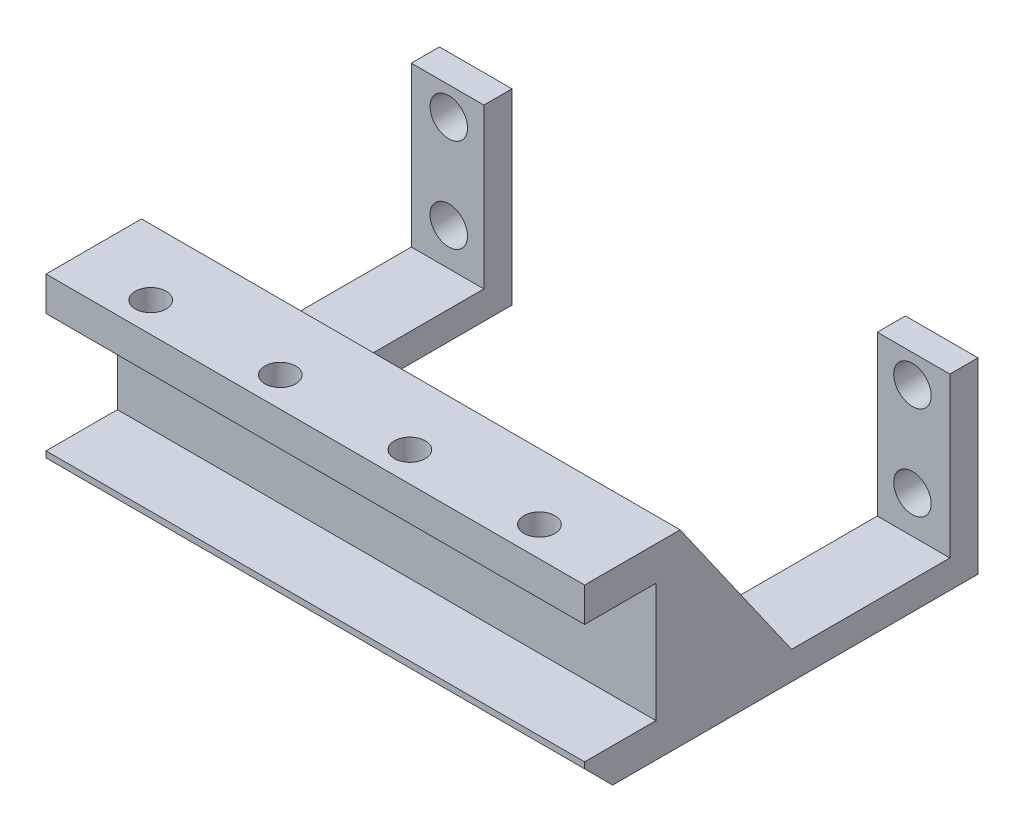
ISO-10303-21;
HEADER;
FILE_DESCRIPTION(('STEP AP214'),'2;1');
FILE_NAME('part.step','',(''),(''),'','','');
FILE_SCHEMA(('AUTOMOTIVE_DESIGN { 1 0 10303 214 1 1 1 1 }'));
ENDSEC;
DATA;
#1=APPLICATION_CONTEXT('core data for automotive mechanical design processes');
#2=APPLICATION_PROTOCOL_DEFINITION('international standard','automotive_design',2000,#1);
#3=PRODUCT_CONTEXT('',#1,'mechanical');
#4=PRODUCT('Part','Part','',(#3));
#5=PRODUCT_RELATED_PRODUCT_CATEGORY('part','',(#4));
#6=PRODUCT_DEFINITION_FORMATION('','',#4);
#7=PRODUCT_DEFINITION_CONTEXT('part definition',#1,'design');
#8=PRODUCT_DEFINITION('design','',#6,#7);
#9=PRODUCT_DEFINITION_SHAPE('','',#8);
#10=(LENGTH_UNIT() NAMED_UNIT(*) SI_UNIT(.MILLI.,.METRE.));
#11=(NAMED_UNIT(*) PLANE_ANGLE_UNIT() SI_UNIT($,.RADIAN.));
#12=(NAMED_UNIT(*) SI_UNIT($,.STERADIAN.) SOLID_ANGLE_UNIT());
#13=UNCERTAINTY_MEASURE_WITH_UNIT(LENGTH_MEASURE(1.E-05),#10,'distance_accuracy_value','');
#14=(GEOMETRIC_REPRESENTATION_CONTEXT(3) GLOBAL_UNCERTAINTY_ASSIGNED_CONTEXT((#13)) GLOBAL_UNIT_ASSIGNED_CONTEXT((#10,
#11,#12)) REPRESENTATION_CONTEXT('',''));
#15=CARTESIAN_POINT('',(0.,0.,0.));
#16=DIRECTION('',(0.,0.,1.));
#17=DIRECTION('',(1.,0.,0.));
#18=AXIS2_PLACEMENT_3D('',#15,#16,#17);
#19=CARTESIAN_POINT('',(0.,20.,0.));
#20=DIRECTION('',(0.,-1.,0.));
#21=DIRECTION('',(0.,0.,-1.));
#22=AXIS2_PLACEMENT_3D('',#19,#20,#21);
#23=PLANE('',#22);
#24=DIRECTION('',(0.,0.,-1.));
#25=VECTOR('',#24,1.);
#26=CARTESIAN_POINT('',(57.5,20.,0.));
#27=LINE('',#26,#25);
#28=CARTESIAN_POINT('',(57.5,20.,0.));
#29=VERTEX_POINT('',#28);
#30=CARTESIAN_POINT('',(57.5,20.,-10.2));
#31=VERTEX_POINT('',#30);
#32=EDGE_CURVE('E285',#29,#31,#27,.T.);
#33=ORIENTED_EDGE('',*,*,#32,.T.);
#34=DIRECTION('',(1.,0.,0.));
#35=VECTOR('',#34,1.);
#36=CARTESIAN_POINT('',(0.,20.,-10.2));
#37=LINE('',#36,#35);
#38=CARTESIAN_POINT('',(44.75,20.,-10.2));
#39=VERTEX_POINT('',#38);
#40=EDGE_CURVE('E375',#39,#31,#37,.T.);
#41=ORIENTED_EDGE('',*,*,#40,.F.);
#42=DIRECTION('',(1.,0.,0.));
#43=VECTOR('',#42,1.);
#44=CARTESIAN_POINT('',(12.75,20.,-10.2));
#45=LINE('',#44,#43);
#46=CARTESIAN_POINT('',(12.75,20.,-10.2));
#47=VERTEX_POINT('',#46);
#48=EDGE_CURVE('E324',#47,#39,#45,.T.);
#49=ORIENTED_EDGE('',*,*,#48,.F.);
#50=CARTESIAN_POINT('',(0.,20.,-10.2));
#51=VERTEX_POINT('',#50);
#52=EDGE_CURVE('E371',#51,#47,#37,.T.);
#53=ORIENTED_EDGE('',*,*,#52,.F.);
#54=DIRECTION('',(0.,0.,1.));
#55=VECTOR('',#54,1.);
#56=CARTESIAN_POINT('',(0.,20.,0.));
#57=LINE('',#56,#55);
#58=CARTESIAN_POINT('',(0.,20.,0.));
#59=VERTEX_POINT('',#58);
#60=EDGE_CURVE('E272',#51,#59,#57,.T.);
#61=ORIENTED_EDGE('',*,*,#60,.T.);
#62=DIRECTION('',(1.,0.,0.));
#63=VECTOR('',#62,1.);
#64=CARTESIAN_POINT('',(0.,20.,0.));
#65=LINE('',#64,#63);
#66=EDGE_CURVE('E290',#59,#29,#65,.T.);
#67=ORIENTED_EDGE('',*,*,#66,.T.);
#68=EDGE_LOOP('',(#33,#41,#49,#53,#61,#67));
#69=FACE_BOUND('',#68,.T.);
#70=CARTESIAN_POINT('',(49.5,20.,-3.18));
#71=DIRECTION('',(0.,1.,0.));
#72=DIRECTION('',(0.,0.,1.));
#73=AXIS2_PLACEMENT_3D('',#70,#71,#72);
#74=CIRCLE('',#73,1.64999999999998);
#75=CARTESIAN_POINT('',(49.5,20.,-1.53000000000002));
#76=VERTEX_POINT('',#75);
#77=EDGE_CURVE('E470',#76,#76,#74,.T.);
#78=ORIENTED_EDGE('',*,*,#77,.F.);
#79=EDGE_LOOP('',(#78));
#80=FACE_BOUND('',#79,.T.);
#81=CARTESIAN_POINT('',(35.6666666666667,20.,-3.18));
#82=DIRECTION('',(0.,1.,0.));
#83=DIRECTION('',(0.,0.,1.));
#84=AXIS2_PLACEMENT_3D('',#81,#82,#83);
#85=CIRCLE('',#84,1.64999999999998);
#86=CARTESIAN_POINT('',(35.6666666666667,20.,-1.53000000000002));
#87=VERTEX_POINT('',#86);
#88=EDGE_CURVE('E478',#87,#87,#85,.T.);
#89=ORIENTED_EDGE('',*,*,#88,.F.);
#90=EDGE_LOOP('',(#89));
#91=FACE_BOUND('',#90,.T.);
#92=CARTESIAN_POINT('',(21.8333333333333,20.,-3.18));
#93=DIRECTION('',(0.,1.,0.));
#94=DIRECTION('',(0.,0.,1.));
#95=AXIS2_PLACEMENT_3D('',#92,#93,#94);
#96=CIRCLE('',#95,1.64999999999999);
#97=CARTESIAN_POINT('',(21.8333333333333,20.,-1.53000000000001));
#98=VERTEX_POINT('',#97);
#99=EDGE_CURVE('E486',#98,#98,#96,.T.);
#100=ORIENTED_EDGE('',*,*,#99,.F.);
#101=EDGE_LOOP('',(#100));
#102=FACE_BOUND('',#101,.T.);
#103=CARTESIAN_POINT('',(8.,20.,-3.18));
#104=DIRECTION('',(0.,1.,0.));
#105=DIRECTION('',(0.,0.,1.));
#106=AXIS2_PLACEMENT_3D('',#103,#104,#105);
#107=CIRCLE('',#106,1.64999999999999);
#108=CARTESIAN_POINT('',(8.,20.,-1.53000000000001));
#109=VERTEX_POINT('',#108);
#110=EDGE_CURVE('E494',#109,#109,#107,.T.);
#111=ORIENTED_EDGE('',*,*,#110,.F.);
#112=EDGE_LOOP('',(#111));
#113=FACE_BOUND('',#112,.T.);
#114=ADVANCED_FACE('F45',(#69,#80,#91,#102,#113),#23,.F.);
#115=CARTESIAN_POINT('',(0.,20.,0.));
#116=DIRECTION('',(0.,0.,-1.));
#117=DIRECTION('',(-1.,0.,0.));
#118=AXIS2_PLACEMENT_3D('',#115,#116,#117);
#119=PLANE('',#118);
#120=DIRECTION('',(0.,-1.,0.));
#121=VECTOR('',#120,1.);
#122=CARTESIAN_POINT('',(0.,20.,0.));
#123=LINE('',#122,#121);
#124=CARTESIAN_POINT('',(0.,16.35,0.));
#125=VERTEX_POINT('',#124);
#126=EDGE_CURVE('E223',#59,#125,#123,.T.);
#127=ORIENTED_EDGE('',*,*,#126,.T.);
#128=DIRECTION('',(1.,0.,0.));
#129=VECTOR('',#128,1.);
#130=CARTESIAN_POINT('',(0.,16.35,0.));
#131=LINE('',#130,#129);
#132=CARTESIAN_POINT('',(57.5,16.35,0.));
#133=VERTEX_POINT('',#132);
#134=EDGE_CURVE('E430',#125,#133,#131,.T.);
#135=ORIENTED_EDGE('',*,*,#134,.T.);
#136=DIRECTION('',(0.,-1.,0.));
#137=VECTOR('',#136,1.);
#138=CARTESIAN_POINT('',(57.5,20.,0.));
#139=LINE('',#138,#137);
#140=EDGE_CURVE('E224',#29,#133,#139,.T.);
#141=ORIENTED_EDGE('',*,*,#140,.F.);
#142=ORIENTED_EDGE('',*,*,#66,.F.);
#143=EDGE_LOOP('',(#127,#135,#141,#142));
#144=FACE_BOUND('',#143,.T.);
#145=ADVANCED_FACE('F502',(#144),#119,.F.);
#146=DIRECTION('',(0.,0.,-1.));
#147=VECTOR('',#146,1.);
#148=CARTESIAN_POINT('',(49.75,20.,-15.2));
#149=LINE('',#148,#147);
#150=CARTESIAN_POINT('',(49.75,20.,-39.));
#151=VERTEX_POINT('',#150);
#152=CARTESIAN_POINT('',(49.75,20.,-42.));
#153=VERTEX_POINT('',#152);
#154=EDGE_CURVE('E320',#151,#153,#149,.T.);
#155=ORIENTED_EDGE('',*,*,#154,.F.);
#156=DIRECTION('',(1.,0.,0.));
#157=VECTOR('',#156,1.);
#158=CARTESIAN_POINT('',(0.,20.,-39.));
#159=LINE('',#158,#157);
#160=CARTESIAN_POINT('',(57.5,20.,-39.));
#161=VERTEX_POINT('',#160);
#162=EDGE_CURVE('E385',#151,#161,#159,.T.);
#163=ORIENTED_EDGE('',*,*,#162,.T.);
#164=CARTESIAN_POINT('',(57.5,20.,-42.));
#165=VERTEX_POINT('',#164);
#166=EDGE_CURVE('E289',#161,#165,#27,.T.);
#167=ORIENTED_EDGE('',*,*,#166,.T.);
#168=DIRECTION('',(-1.,0.,0.));
#169=VECTOR('',#168,1.);
#170=CARTESIAN_POINT('',(0.,20.,-42.));
#171=LINE('',#170,#169);
#172=EDGE_CURVE('E266',#165,#153,#171,.T.);
#173=ORIENTED_EDGE('',*,*,#172,.T.);
#174=EDGE_LOOP('',(#155,#163,#167,#173));
#175=FACE_BOUND('',#174,.T.);
#176=ADVANCED_FACE('F505',(#175),#23,.F.);
#177=CARTESIAN_POINT('',(0.,20.,-42.));
#178=VERTEX_POINT('',#177);
#179=CARTESIAN_POINT('',(0.,20.,-39.));
#180=VERTEX_POINT('',#179);
#181=EDGE_CURVE('E293',#178,#180,#57,.T.);
#182=ORIENTED_EDGE('',*,*,#181,.T.);
#183=CARTESIAN_POINT('',(7.75,20.,-39.));
#184=VERTEX_POINT('',#183);
#185=EDGE_CURVE('E370',#180,#184,#159,.T.);
#186=ORIENTED_EDGE('',*,*,#185,.T.);
#187=DIRECTION('',(0.,0.,1.));
#188=VECTOR('',#187,1.);
#189=CARTESIAN_POINT('',(7.75,20.,-42.));
#190=LINE('',#189,#188);
#191=CARTESIAN_POINT('',(7.75,20.,-42.));
#192=VERTEX_POINT('',#191);
#193=EDGE_CURVE('E328',#192,#184,#190,.T.);
#194=ORIENTED_EDGE('',*,*,#193,.F.);
#195=EDGE_CURVE('E284',#192,#178,#171,.T.);
#196=ORIENTED_EDGE('',*,*,#195,.T.);
#197=EDGE_LOOP('',(#182,#186,#194,#196));
#198=FACE_BOUND('',#197,.T.);
#199=ADVANCED_FACE('F506',(#198),#23,.F.);
#200=CARTESIAN_POINT('',(0.,20.,-42.));
#201=DIRECTION('',(0.,0.,1.));
#202=DIRECTION('',(1.,0.,0.));
#203=AXIS2_PLACEMENT_3D('',#200,#201,#202);
#204=PLANE('',#203);
#205=CARTESIAN_POINT('',(53.5,7.,-42.));
#206=DIRECTION('',(0.,0.,-1.));
#207=DIRECTION('',(-1.,0.,0.));
#208=AXIS2_PLACEMENT_3D('',#205,#206,#207);
#209=CIRCLE('',#208,2.);
#210=CARTESIAN_POINT('',(51.5,7.,-42.));
#211=VERTEX_POINT('',#210);
#212=EDGE_CURVE('E426',#211,#211,#209,.T.);
#213=ORIENTED_EDGE('',*,*,#212,.F.);
#214=EDGE_LOOP('',(#213));
#215=FACE_BOUND('',#214,.T.);
#216=CARTESIAN_POINT('',(53.5,17.,-42.));
#217=DIRECTION('',(0.,0.,-1.));
#218=DIRECTION('',(-1.,0.,0.));
#219=AXIS2_PLACEMENT_3D('',#216,#217,#218);
#220=CIRCLE('',#219,2.);
#221=CARTESIAN_POINT('',(51.5,17.,-42.));
#222=VERTEX_POINT('',#221);
#223=EDGE_CURVE('E416',#222,#222,#220,.T.);
#224=ORIENTED_EDGE('',*,*,#223,.F.);
#225=EDGE_LOOP('',(#224));
#226=FACE_BOUND('',#225,.T.);
#227=DIRECTION('',(-1.,0.,0.));
#228=VECTOR('',#227,1.);
#229=CARTESIAN_POINT('',(0.,0.,-42.));
#230=LINE('',#229,#228);
#231=CARTESIAN_POINT('',(57.5,0.,-42.));
#232=VERTEX_POINT('',#231);
#233=CARTESIAN_POINT('',(49.75,0.,-42.));
#234=VERTEX_POINT('',#233);
#235=EDGE_CURVE('E269',#232,#234,#230,.T.);
#236=ORIENTED_EDGE('',*,*,#235,.T.);
#237=DIRECTION('',(0.,1.,0.));
#238=VECTOR('',#237,1.);
#239=CARTESIAN_POINT('',(49.75,0.,-42.));
#240=LINE('',#239,#238);
#241=EDGE_CURVE('E280',#234,#153,#240,.T.);
#242=ORIENTED_EDGE('',*,*,#241,.T.);
#243=ORIENTED_EDGE('',*,*,#172,.F.);
#244=DIRECTION('',(0.,-1.,0.));
#245=VECTOR('',#244,1.);
#246=CARTESIAN_POINT('',(57.5,20.,-42.));
#247=LINE('',#246,#245);
#248=EDGE_CURVE('E255',#165,#232,#247,.T.);
#249=ORIENTED_EDGE('',*,*,#248,.T.);
#250=EDGE_LOOP('',(#236,#242,#243,#249));
#251=FACE_BOUND('',#250,.T.);
#252=ADVANCED_FACE('F518',(#215,#226,#251),#204,.F.);
#253=CARTESIAN_POINT('',(0.,20.,0.));
#254=DIRECTION('',(1.,0.,0.));
#255=DIRECTION('',(0.,0.,-1.));
#256=AXIS2_PLACEMENT_3D('',#253,#254,#255);
#257=PLANE('',#256);
#258=DIRECTION('',(0.,0.,1.));
#259=VECTOR('',#258,1.);
#260=CARTESIAN_POINT('',(0.,0.,0.));
#261=LINE('',#260,#259);
#262=CARTESIAN_POINT('',(0.,0.,-42.));
#263=VERTEX_POINT('',#262);
#264=CARTESIAN_POINT('',(0.,0.,-3.00000000000003));
#265=VERTEX_POINT('',#264);
#266=EDGE_CURVE('E277',#263,#265,#261,.T.);
#267=ORIENTED_EDGE('',*,*,#266,.T.);
#268=DIRECTION('',(0.,0.707106781186546,0.707106781186549));
#269=VECTOR('',#268,1.);
#270=CARTESIAN_POINT('',(0.,3.00000000000002,0.));
#271=LINE('',#270,#269);
#272=CARTESIAN_POINT('',(0.,3.00000000000002,0.));
#273=VERTEX_POINT('',#272);
#274=EDGE_CURVE('E11',#265,#273,#271,.T.);
#275=ORIENTED_EDGE('',*,*,#274,.T.);
#276=CARTESIAN_POINT('',(0.,3.65,0.));
#277=VERTEX_POINT('',#276);
#278=EDGE_CURVE('E214',#277,#273,#123,.T.);
#279=ORIENTED_EDGE('',*,*,#278,.F.);
#280=DIRECTION('',(0.,0.,-1.));
#281=VECTOR('',#280,1.);
#282=CARTESIAN_POINT('',(0.,3.65,0.));
#283=LINE('',#282,#281);
#284=CARTESIAN_POINT('',(0.,3.65,-7.62));
#285=VERTEX_POINT('',#284);
#286=EDGE_CURVE('E194',#277,#285,#283,.T.);
#287=ORIENTED_EDGE('',*,*,#286,.T.);
#288=DIRECTION('',(0.,1.,0.));
#289=VECTOR('',#288,1.);
#290=CARTESIAN_POINT('',(0.,3.65,-7.62));
#291=LINE('',#290,#289);
#292=CARTESIAN_POINT('',(0.,16.35,-7.62));
#293=VERTEX_POINT('',#292);
#294=EDGE_CURVE('E206',#285,#293,#291,.T.);
#295=ORIENTED_EDGE('',*,*,#294,.T.);
#296=DIRECTION('',(0.,0.,1.));
#297=VECTOR('',#296,1.);
#298=CARTESIAN_POINT('',(0.,16.35,0.));
#299=LINE('',#298,#297);
#300=EDGE_CURVE('E218',#293,#125,#299,.T.);
#301=ORIENTED_EDGE('',*,*,#300,.T.);
#302=ORIENTED_EDGE('',*,*,#126,.F.);
#303=ORIENTED_EDGE('',*,*,#60,.F.);
#304=DIRECTION('',(0.,-0.819152044288991,-0.573576436351047));
#305=VECTOR('',#304,1.);
#306=CARTESIAN_POINT('',(0.,3.,-22.1035281495651));
#307=LINE('',#306,#305);
#308=CARTESIAN_POINT('',(0.,3.,-22.1035281495651));
#309=VERTEX_POINT('',#308);
#310=EDGE_CURVE('E392',#51,#309,#307,.T.);
#311=ORIENTED_EDGE('',*,*,#310,.T.);
#312=DIRECTION('',(0.,0.,-1.));
#313=VECTOR('',#312,1.);
#314=CARTESIAN_POINT('',(0.,3.,-39.));
#315=LINE('',#314,#313);
#316=CARTESIAN_POINT('',(0.,3.,-39.));
#317=VERTEX_POINT('',#316);
#318=EDGE_CURVE('E406',#309,#317,#315,.T.);
#319=ORIENTED_EDGE('',*,*,#318,.T.);
#320=DIRECTION('',(0.,1.,0.));
#321=VECTOR('',#320,1.);
#322=CARTESIAN_POINT('',(0.,20.,-39.));
#323=LINE('',#322,#321);
#324=EDGE_CURVE('E402',#317,#180,#323,.T.);
#325=ORIENTED_EDGE('',*,*,#324,.T.);
#326=ORIENTED_EDGE('',*,*,#181,.F.);
#327=DIRECTION('',(0.,-1.,0.));
#328=VECTOR('',#327,1.);
#329=CARTESIAN_POINT('',(0.,20.,-42.));
#330=LINE('',#329,#328);
#331=EDGE_CURVE('E258',#178,#263,#330,.T.);
#332=ORIENTED_EDGE('',*,*,#331,.T.);
#333=EDGE_LOOP('',(#267,#275,#279,#287,#295,#301,#302,#303,#311,#319,#325,#326,#332));
#334=FACE_BOUND('',#333,.T.);
#335=ADVANCED_FACE('F220',(#334),#257,.F.);
#336=ORIENTED_EDGE('',*,*,#278,.T.);
#337=DIRECTION('',(1.,0.,0.));
#338=VECTOR('',#337,1.);
#339=CARTESIAN_POINT('',(57.5,3.00000000000002,0.));
#340=LINE('',#339,#338);
#341=CARTESIAN_POINT('',(57.5,3.00000000000002,0.));
#342=VERTEX_POINT('',#341);
#343=EDGE_CURVE('E245',#273,#342,#340,.T.);
#344=ORIENTED_EDGE('',*,*,#343,.T.);
#345=CARTESIAN_POINT('',(57.5,3.65,0.));
#346=VERTEX_POINT('',#345);
#347=EDGE_CURVE('E216',#346,#342,#139,.T.);
#348=ORIENTED_EDGE('',*,*,#347,.F.);
#349=DIRECTION('',(1.,0.,0.));
#350=VECTOR('',#349,1.);
#351=CARTESIAN_POINT('',(0.,3.65,0.));
#352=LINE('',#351,#350);
#353=EDGE_CURVE('E198',#277,#346,#352,.T.);
#354=ORIENTED_EDGE('',*,*,#353,.F.);
#355=EDGE_LOOP('',(#336,#344,#348,#354));
#356=FACE_BOUND('',#355,.T.);
#357=ADVANCED_FACE('F212',(#356),#119,.F.);
#358=CARTESIAN_POINT('',(57.5,20.,0.));
#359=DIRECTION('',(-1.,0.,0.));
#360=DIRECTION('',(0.,0.,1.));
#361=AXIS2_PLACEMENT_3D('',#358,#359,#360);
#362=PLANE('',#361);
#363=ORIENTED_EDGE('',*,*,#347,.T.);
#364=DIRECTION('',(0.,-0.707106781186546,-0.707106781186549));
#365=VECTOR('',#364,1.);
#366=CARTESIAN_POINT('',(57.5,3.00000000000002,0.));
#367=LINE('',#366,#365);
#368=CARTESIAN_POINT('',(57.5,0.,-3.00000000000003));
#369=VERTEX_POINT('',#368);
#370=EDGE_CURVE('E69',#342,#369,#367,.T.);
#371=ORIENTED_EDGE('',*,*,#370,.T.);
#372=DIRECTION('',(0.,0.,-1.));
#373=VECTOR('',#372,1.);
#374=CARTESIAN_POINT('',(57.5,0.,0.));
#375=LINE('',#374,#373);
#376=EDGE_CURVE('E274',#369,#232,#375,.T.);
#377=ORIENTED_EDGE('',*,*,#376,.T.);
#378=ORIENTED_EDGE('',*,*,#248,.F.);
#379=ORIENTED_EDGE('',*,*,#166,.F.);
#380=DIRECTION('',(0.,1.,0.));
#381=VECTOR('',#380,1.);
#382=CARTESIAN_POINT('',(57.5,20.,-39.));
#383=LINE('',#382,#381);
#384=CARTESIAN_POINT('',(57.5,3.,-39.));
#385=VERTEX_POINT('',#384);
#386=EDGE_CURVE('E389',#385,#161,#383,.T.);
#387=ORIENTED_EDGE('',*,*,#386,.F.);
#388=DIRECTION('',(0.,0.,-1.));
#389=VECTOR('',#388,1.);
#390=CARTESIAN_POINT('',(57.5,3.,-39.));
#391=LINE('',#390,#389);
#392=CARTESIAN_POINT('',(57.5,3.,-22.1035281495651));
#393=VERTEX_POINT('',#392);
#394=EDGE_CURVE('E393',#393,#385,#391,.T.);
#395=ORIENTED_EDGE('',*,*,#394,.F.);
#396=DIRECTION('',(0.,-0.819152044288991,-0.573576436351047));
#397=VECTOR('',#396,1.);
#398=CARTESIAN_POINT('',(57.5,3.,-22.1035281495651));
#399=LINE('',#398,#397);
#400=EDGE_CURVE('E397',#31,#393,#399,.T.);
#401=ORIENTED_EDGE('',*,*,#400,.F.);
#402=ORIENTED_EDGE('',*,*,#32,.F.);
#403=ORIENTED_EDGE('',*,*,#140,.T.);
#404=DIRECTION('',(0.,0.,1.));
#405=VECTOR('',#404,1.);
#406=CARTESIAN_POINT('',(57.5,16.35,0.));
#407=LINE('',#406,#405);
#408=CARTESIAN_POINT('',(57.5,16.35,-7.62));
#409=VERTEX_POINT('',#408);
#410=EDGE_CURVE('E207',#409,#133,#407,.T.);
#411=ORIENTED_EDGE('',*,*,#410,.F.);
#412=DIRECTION('',(0.,1.,0.));
#413=VECTOR('',#412,1.);
#414=CARTESIAN_POINT('',(57.5,3.65,-7.62));
#415=LINE('',#414,#413);
#416=CARTESIAN_POINT('',(57.5,3.65,-7.62));
#417=VERTEX_POINT('',#416);
#418=EDGE_CURVE('E455',#417,#409,#415,.T.);
#419=ORIENTED_EDGE('',*,*,#418,.F.);
#420=DIRECTION('',(0.,0.,-1.));
#421=VECTOR('',#420,1.);
#422=CARTESIAN_POINT('',(57.5,3.65,0.));
#423=LINE('',#422,#421);
#424=EDGE_CURVE('E253',#346,#417,#423,.T.);
#425=ORIENTED_EDGE('',*,*,#424,.F.);
#426=EDGE_LOOP('',(#363,#371,#377,#378,#379,#387,#395,#401,#402,#403,#411,#419,#425));
#427=FACE_BOUND('',#426,.T.);
#428=ADVANCED_FACE('F251',(#427),#362,.F.);
#429=CARTESIAN_POINT('',(4.,7.,-42.));
#430=DIRECTION('',(0.,0.,-1.));
#431=DIRECTION('',(-1.,0.,0.));
#432=AXIS2_PLACEMENT_3D('',#429,#430,#431);
#433=CIRCLE('',#432,2.);
#434=CARTESIAN_POINT('',(2.,7.,-42.));
#435=VERTEX_POINT('',#434);
#436=EDGE_CURVE('E431',#435,#435,#433,.T.);
#437=ORIENTED_EDGE('',*,*,#436,.F.);
#438=EDGE_LOOP('',(#437));
#439=FACE_BOUND('',#438,.T.);
#440=CARTESIAN_POINT('',(4.,17.,-42.));
#441=DIRECTION('',(0.,0.,-1.));
#442=DIRECTION('',(-1.,0.,0.));
#443=AXIS2_PLACEMENT_3D('',#440,#441,#442);
#444=CIRCLE('',#443,2.);
#445=CARTESIAN_POINT('',(1.99999999999999,17.,-42.));
#446=VERTEX_POINT('',#445);
#447=EDGE_CURVE('E420',#446,#446,#444,.T.);
#448=ORIENTED_EDGE('',*,*,#447,.F.);
#449=EDGE_LOOP('',(#448));
#450=FACE_BOUND('',#449,.T.);
#451=ORIENTED_EDGE('',*,*,#195,.F.);
#452=DIRECTION('',(0.,1.,0.));
#453=VECTOR('',#452,1.);
#454=CARTESIAN_POINT('',(7.75,0.,-42.));
#455=LINE('',#454,#453);
#456=CARTESIAN_POINT('',(7.75,0.,-42.));
#457=VERTEX_POINT('',#456);
#458=EDGE_CURVE('E297',#457,#192,#455,.T.);
#459=ORIENTED_EDGE('',*,*,#458,.F.);
#460=EDGE_CURVE('E273',#457,#263,#230,.T.);
#461=ORIENTED_EDGE('',*,*,#460,.T.);
#462=ORIENTED_EDGE('',*,*,#331,.F.);
#463=EDGE_LOOP('',(#451,#459,#461,#462));
#464=FACE_BOUND('',#463,.T.);
#465=ADVANCED_FACE('F525',(#439,#450,#464),#204,.F.);
#466=CARTESIAN_POINT('',(0.,0.,0.));
#467=DIRECTION('',(0.,-1.,0.));
#468=DIRECTION('',(0.,0.,-1.));
#469=AXIS2_PLACEMENT_3D('',#466,#467,#468);
#470=PLANE('',#469);
#471=ORIENTED_EDGE('',*,*,#376,.F.);
#472=DIRECTION('',(-1.,0.,0.));
#473=VECTOR('',#472,1.);
#474=CARTESIAN_POINT('',(0.,0.,-3.00000000000003));
#475=LINE('',#474,#473);
#476=EDGE_CURVE('E55',#369,#265,#475,.T.);
#477=ORIENTED_EDGE('',*,*,#476,.T.);
#478=ORIENTED_EDGE('',*,*,#266,.F.);
#479=ORIENTED_EDGE('',*,*,#460,.F.);
#480=DIRECTION('',(0.,0.,1.));
#481=VECTOR('',#480,1.);
#482=CARTESIAN_POINT('',(7.75,0.,-42.));
#483=LINE('',#482,#481);
#484=CARTESIAN_POINT('',(7.75,0.,-15.2));
#485=VERTEX_POINT('',#484);
#486=EDGE_CURVE('E323',#457,#485,#483,.T.);
#487=ORIENTED_EDGE('',*,*,#486,.T.);
#488=CARTESIAN_POINT('',(12.75,0.,-15.2));
#489=DIRECTION('',(0.,1.,0.));
#490=DIRECTION('',(0.,0.,1.));
#491=AXIS2_PLACEMENT_3D('',#488,#489,#490);
#492=CIRCLE('',#491,5.);
#493=CARTESIAN_POINT('',(12.75,0.,-10.2));
#494=VERTEX_POINT('',#493);
#495=EDGE_CURVE('E344',#485,#494,#492,.T.);
#496=ORIENTED_EDGE('',*,*,#495,.T.);
#497=DIRECTION('',(1.,0.,0.));
#498=VECTOR('',#497,1.);
#499=CARTESIAN_POINT('',(12.75,0.,-10.2));
#500=LINE('',#499,#498);
#501=CARTESIAN_POINT('',(44.75,0.,-10.2));
#502=VERTEX_POINT('',#501);
#503=EDGE_CURVE('E340',#494,#502,#500,.T.);
#504=ORIENTED_EDGE('',*,*,#503,.T.);
#505=CARTESIAN_POINT('',(44.75,0.,-15.2));
#506=DIRECTION('',(0.,1.,0.));
#507=DIRECTION('',(0.,0.,1.));
#508=AXIS2_PLACEMENT_3D('',#505,#506,#507);
#509=CIRCLE('',#508,5.);
#510=CARTESIAN_POINT('',(49.75,0.,-15.2));
#511=VERTEX_POINT('',#510);
#512=EDGE_CURVE('E336',#502,#511,#509,.T.);
#513=ORIENTED_EDGE('',*,*,#512,.T.);
#514=DIRECTION('',(0.,0.,-1.));
#515=VECTOR('',#514,1.);
#516=CARTESIAN_POINT('',(49.75,0.,-15.2));
#517=LINE('',#516,#515);
#518=EDGE_CURVE('E301',#511,#234,#517,.T.);
#519=ORIENTED_EDGE('',*,*,#518,.T.);
#520=ORIENTED_EDGE('',*,*,#235,.F.);
#521=EDGE_LOOP('',(#471,#477,#478,#479,#487,#496,#504,#513,#519,#520));
#522=FACE_BOUND('',#521,.T.);
#523=ADVANCED_FACE('F577',(#522),#470,.T.);
#524=CARTESIAN_POINT('',(49.75,0.,-15.2));
#525=DIRECTION('',(1.,0.,0.));
#526=DIRECTION('',(0.,0.,-1.));
#527=AXIS2_PLACEMENT_3D('',#524,#525,#526);
#528=PLANE('',#527);
#529=DIRECTION('',(0.,0.,-1.));
#530=VECTOR('',#529,1.);
#531=CARTESIAN_POINT('',(49.75,3.,-15.2));
#532=LINE('',#531,#530);
#533=CARTESIAN_POINT('',(49.75,3.,-22.1035281495651));
#534=VERTEX_POINT('',#533);
#535=CARTESIAN_POINT('',(49.75,3.,-39.));
#536=VERTEX_POINT('',#535);
#537=EDGE_CURVE('E354',#534,#536,#532,.T.);
#538=ORIENTED_EDGE('',*,*,#537,.T.);
#539=DIRECTION('',(0.,1.,0.));
#540=VECTOR('',#539,1.);
#541=CARTESIAN_POINT('',(49.75,0.,-39.));
#542=LINE('',#541,#540);
#543=EDGE_CURVE('E332',#536,#151,#542,.T.);
#544=ORIENTED_EDGE('',*,*,#543,.T.);
#545=ORIENTED_EDGE('',*,*,#154,.T.);
#546=ORIENTED_EDGE('',*,*,#241,.F.);
#547=ORIENTED_EDGE('',*,*,#518,.F.);
#548=DIRECTION('',(0.,1.,0.));
#549=VECTOR('',#548,1.);
#550=CARTESIAN_POINT('',(49.75,0.,-15.2));
#551=LINE('',#550,#549);
#552=CARTESIAN_POINT('',(49.75,12.8592599662894,-15.2));
#553=VERTEX_POINT('',#552);
#554=EDGE_CURVE('E313',#511,#553,#551,.T.);
#555=ORIENTED_EDGE('',*,*,#554,.T.);
#556=DIRECTION('',(0.,-0.819152044288991,-0.573576436351047));
#557=VECTOR('',#556,1.);
#558=CARTESIAN_POINT('',(49.75,4.23056701477857,-21.2418758495449));
#559=LINE('',#558,#557);
#560=EDGE_CURVE('E358',#553,#534,#559,.T.);
#561=ORIENTED_EDGE('',*,*,#560,.T.);
#562=EDGE_LOOP('',(#538,#544,#545,#546,#547,#555,#561));
#563=FACE_BOUND('',#562,.T.);
#564=ADVANCED_FACE('F634',(#563),#528,.F.);
#565=CARTESIAN_POINT('',(44.75,0.,-15.2));
#566=DIRECTION('',(0.,1.,0.));
#567=DIRECTION('',(0.,0.,1.));
#568=AXIS2_PLACEMENT_3D('',#565,#566,#567);
#569=CYLINDRICAL_SURFACE('',#568,5.);
#570=DIRECTION('',(0.,1.,0.));
#571=VECTOR('',#570,1.);
#572=CARTESIAN_POINT('',(44.75,0.,-10.2));
#573=LINE('',#572,#571);
#574=EDGE_CURVE('E309',#502,#39,#573,.T.);
#575=ORIENTED_EDGE('',*,*,#574,.T.);
#576=CARTESIAN_POINT('',(44.75,12.8592599662894,-15.2));
#577=DIRECTION('',(0.,-0.573576436351047,0.819152044288991));
#578=DIRECTION('',(0.,0.819152044288991,0.573576436351047));
#579=AXIS2_PLACEMENT_3D('',#576,#577,#578);
#580=ELLIPSE('',#579,8.71723397810547,5.);
#581=EDGE_CURVE('E362',#39,#553,#580,.F.);
#582=ORIENTED_EDGE('',*,*,#581,.T.);
#583=ORIENTED_EDGE('',*,*,#554,.F.);
#584=ORIENTED_EDGE('',*,*,#512,.F.);
#585=EDGE_LOOP('',(#575,#582,#583,#584));
#586=FACE_BOUND('',#585,.T.);
#587=ADVANCED_FACE('F637',(#586),#569,.F.);
#588=CARTESIAN_POINT('',(12.75,0.,-10.2));
#589=DIRECTION('',(0.,0.,1.));
#590=DIRECTION('',(1.,0.,0.));
#591=AXIS2_PLACEMENT_3D('',#588,#589,#590);
#592=PLANE('',#591);
#593=ORIENTED_EDGE('',*,*,#48,.T.);
#594=ORIENTED_EDGE('',*,*,#574,.F.);
#595=ORIENTED_EDGE('',*,*,#503,.F.);
#596=DIRECTION('',(0.,1.,0.));
#597=VECTOR('',#596,1.);
#598=CARTESIAN_POINT('',(12.75,0.,-10.2));
#599=LINE('',#598,#597);
#600=EDGE_CURVE('E305',#494,#47,#599,.T.);
#601=ORIENTED_EDGE('',*,*,#600,.T.);
#602=EDGE_LOOP('',(#593,#594,#595,#601));
#603=FACE_BOUND('',#602,.T.);
#604=ADVANCED_FACE('F571',(#603),#592,.F.);
#605=CARTESIAN_POINT('',(12.75,0.,-15.2));
#606=DIRECTION('',(0.,1.,0.));
#607=DIRECTION('',(0.,0.,1.));
#608=AXIS2_PLACEMENT_3D('',#605,#606,#607);
#609=CYLINDRICAL_SURFACE('',#608,5.);
#610=DIRECTION('',(0.,1.,0.));
#611=VECTOR('',#610,1.);
#612=CARTESIAN_POINT('',(7.75,0.,-15.2));
#613=LINE('',#612,#611);
#614=CARTESIAN_POINT('',(7.75,12.8592599662895,-15.2));
#615=VERTEX_POINT('',#614);
#616=EDGE_CURVE('E300',#485,#615,#613,.T.);
#617=ORIENTED_EDGE('',*,*,#616,.T.);
#618=CARTESIAN_POINT('',(12.75,12.8592599662894,-15.2));
#619=DIRECTION('',(0.,-0.573576436351047,0.819152044288991));
#620=DIRECTION('',(0.,0.819152044288991,0.573576436351047));
#621=AXIS2_PLACEMENT_3D('',#618,#619,#620);
#622=ELLIPSE('',#621,8.71723397810547,5.);
#623=EDGE_CURVE('E366',#615,#47,#622,.F.);
#624=ORIENTED_EDGE('',*,*,#623,.T.);
#625=ORIENTED_EDGE('',*,*,#600,.F.);
#626=ORIENTED_EDGE('',*,*,#495,.F.);
#627=EDGE_LOOP('',(#617,#624,#625,#626));
#628=FACE_BOUND('',#627,.T.);
#629=ADVANCED_FACE('F575',(#628),#609,.F.);
#630=CARTESIAN_POINT('',(7.75,0.,-42.));
#631=DIRECTION('',(-1.,0.,0.));
#632=DIRECTION('',(0.,0.,1.));
#633=AXIS2_PLACEMENT_3D('',#630,#631,#632);
#634=PLANE('',#633);
#635=ORIENTED_EDGE('',*,*,#193,.T.);
#636=DIRECTION('',(0.,-1.,0.));
#637=VECTOR('',#636,1.);
#638=CARTESIAN_POINT('',(7.75,0.,-39.));
#639=LINE('',#638,#637);
#640=CARTESIAN_POINT('',(7.75,3.,-39.));
#641=VERTEX_POINT('',#640);
#642=EDGE_CURVE('E241',#184,#641,#639,.T.);
#643=ORIENTED_EDGE('',*,*,#642,.T.);
#644=DIRECTION('',(0.,0.,1.));
#645=VECTOR('',#644,1.);
#646=CARTESIAN_POINT('',(7.75,3.,-42.));
#647=LINE('',#646,#645);
#648=CARTESIAN_POINT('',(7.75,3.,-22.1035281495651));
#649=VERTEX_POINT('',#648);
#650=EDGE_CURVE('E237',#641,#649,#647,.T.);
#651=ORIENTED_EDGE('',*,*,#650,.T.);
#652=DIRECTION('',(0.,0.819152044288991,0.573576436351047));
#653=VECTOR('',#652,1.);
#654=CARTESIAN_POINT('',(7.75,-8.36131410375262,-30.058805928981));
#655=LINE('',#654,#653);
#656=EDGE_CURVE('E229',#649,#615,#655,.T.);
#657=ORIENTED_EDGE('',*,*,#656,.T.);
#658=ORIENTED_EDGE('',*,*,#616,.F.);
#659=ORIENTED_EDGE('',*,*,#486,.F.);
#660=ORIENTED_EDGE('',*,*,#458,.T.);
#661=EDGE_LOOP('',(#635,#643,#651,#657,#658,#659,#660));
#662=FACE_BOUND('',#661,.T.);
#663=ADVANCED_FACE('F535',(#662),#634,.F.);
#664=CARTESIAN_POINT('',(0.,3.,-22.1035281495651));
#665=DIRECTION('',(0.,-0.573576436351047,0.819152044288991));
#666=DIRECTION('',(0.,-0.819152044288991,-0.573576436351047));
#667=AXIS2_PLACEMENT_3D('',#664,#665,#666);
#668=PLANE('',#667);
#669=ORIENTED_EDGE('',*,*,#656,.F.);
#670=DIRECTION('',(1.,0.,0.));
#671=VECTOR('',#670,1.);
#672=CARTESIAN_POINT('',(0.,3.,-22.1035281495651));
#673=LINE('',#672,#671);
#674=EDGE_CURVE('E376',#309,#649,#673,.T.);
#675=ORIENTED_EDGE('',*,*,#674,.F.);
#676=ORIENTED_EDGE('',*,*,#310,.F.);
#677=ORIENTED_EDGE('',*,*,#52,.T.);
#678=ORIENTED_EDGE('',*,*,#623,.F.);
#679=EDGE_LOOP('',(#669,#675,#676,#677,#678));
#680=FACE_BOUND('',#679,.T.);
#681=ADVANCED_FACE('F569',(#680),#668,.F.);
#682=CARTESIAN_POINT('',(0.,3.,-39.));
#683=DIRECTION('',(0.,-1.,0.));
#684=DIRECTION('',(0.,0.,-1.));
#685=AXIS2_PLACEMENT_3D('',#682,#683,#684);
#686=PLANE('',#685);
#687=DIRECTION('',(1.,0.,0.));
#688=VECTOR('',#687,1.);
#689=CARTESIAN_POINT('',(0.,3.,-39.));
#690=LINE('',#689,#688);
#691=EDGE_CURVE('E381',#317,#641,#690,.T.);
#692=ORIENTED_EDGE('',*,*,#691,.F.);
#693=ORIENTED_EDGE('',*,*,#318,.F.);
#694=ORIENTED_EDGE('',*,*,#674,.T.);
#695=ORIENTED_EDGE('',*,*,#650,.F.);
#696=EDGE_LOOP('',(#692,#693,#694,#695));
#697=FACE_BOUND('',#696,.T.);
#698=ADVANCED_FACE('F631',(#697),#686,.F.);
#699=CARTESIAN_POINT('',(0.,20.,-39.));
#700=DIRECTION('',(0.,0.,-1.));
#701=DIRECTION('',(-1.,0.,0.));
#702=AXIS2_PLACEMENT_3D('',#699,#700,#701);
#703=PLANE('',#702);
#704=CARTESIAN_POINT('',(4.,7.,-39.));
#705=DIRECTION('',(0.,0.,-1.));
#706=DIRECTION('',(-1.,0.,0.));
#707=AXIS2_PLACEMENT_3D('',#704,#705,#706);
#708=CIRCLE('',#707,2.);
#709=CARTESIAN_POINT('',(2.,7.,-39.));
#710=VERTEX_POINT('',#709);
#711=EDGE_CURVE('E425',#710,#710,#708,.F.);
#712=ORIENTED_EDGE('',*,*,#711,.F.);
#713=EDGE_LOOP('',(#712));
#714=FACE_BOUND('',#713,.T.);
#715=CARTESIAN_POINT('',(4.,17.,-39.));
#716=DIRECTION('',(0.,0.,-1.));
#717=DIRECTION('',(-1.,0.,0.));
#718=AXIS2_PLACEMENT_3D('',#715,#716,#717);
#719=CIRCLE('',#718,2.);
#720=CARTESIAN_POINT('',(1.99999999999999,17.,-39.));
#721=VERTEX_POINT('',#720);
#722=EDGE_CURVE('E435',#721,#721,#719,.F.);
#723=ORIENTED_EDGE('',*,*,#722,.F.);
#724=EDGE_LOOP('',(#723));
#725=FACE_BOUND('',#724,.T.);
#726=ORIENTED_EDGE('',*,*,#185,.F.);
#727=ORIENTED_EDGE('',*,*,#324,.F.);
#728=ORIENTED_EDGE('',*,*,#691,.T.);
#729=ORIENTED_EDGE('',*,*,#642,.F.);
#730=EDGE_LOOP('',(#726,#727,#728,#729));
#731=FACE_BOUND('',#730,.T.);
#732=ADVANCED_FACE('F533',(#714,#725,#731),#703,.F.);
#733=CARTESIAN_POINT('',(53.5,7.,-39.));
#734=DIRECTION('',(0.,0.,-1.));
#735=DIRECTION('',(-1.,0.,0.));
#736=AXIS2_PLACEMENT_3D('',#733,#734,#735);
#737=CIRCLE('',#736,2.);
#738=CARTESIAN_POINT('',(51.5,7.,-39.));
#739=VERTEX_POINT('',#738);
#740=EDGE_CURVE('E421',#739,#739,#737,.F.);
#741=ORIENTED_EDGE('',*,*,#740,.F.);
#742=EDGE_LOOP('',(#741));
#743=FACE_BOUND('',#742,.T.);
#744=CARTESIAN_POINT('',(53.5,17.,-39.));
#745=DIRECTION('',(0.,0.,-1.));
#746=DIRECTION('',(-1.,0.,0.));
#747=AXIS2_PLACEMENT_3D('',#744,#745,#746);
#748=CIRCLE('',#747,2.);
#749=CARTESIAN_POINT('',(51.5,17.,-39.));
#750=VERTEX_POINT('',#749);
#751=EDGE_CURVE('E401',#750,#750,#748,.F.);
#752=ORIENTED_EDGE('',*,*,#751,.F.);
#753=EDGE_LOOP('',(#752));
#754=FACE_BOUND('',#753,.T.);
#755=EDGE_CURVE('E380',#536,#385,#690,.T.);
#756=ORIENTED_EDGE('',*,*,#755,.T.);
#757=ORIENTED_EDGE('',*,*,#386,.T.);
#758=ORIENTED_EDGE('',*,*,#162,.F.);
#759=ORIENTED_EDGE('',*,*,#543,.F.);
#760=EDGE_LOOP('',(#756,#757,#758,#759));
#761=FACE_BOUND('',#760,.T.);
#762=ADVANCED_FACE('F623',(#743,#754,#761),#703,.F.);
#763=EDGE_CURVE('E374',#534,#393,#673,.T.);
#764=ORIENTED_EDGE('',*,*,#763,.T.);
#765=ORIENTED_EDGE('',*,*,#394,.T.);
#766=ORIENTED_EDGE('',*,*,#755,.F.);
#767=ORIENTED_EDGE('',*,*,#537,.F.);
#768=EDGE_LOOP('',(#764,#765,#766,#767));
#769=FACE_BOUND('',#768,.T.);
#770=ADVANCED_FACE('F626',(#769),#686,.F.);
#771=ORIENTED_EDGE('',*,*,#581,.F.);
#772=ORIENTED_EDGE('',*,*,#40,.T.);
#773=ORIENTED_EDGE('',*,*,#400,.T.);
#774=ORIENTED_EDGE('',*,*,#763,.F.);
#775=ORIENTED_EDGE('',*,*,#560,.F.);
#776=EDGE_LOOP('',(#771,#772,#773,#774,#775));
#777=FACE_BOUND('',#776,.T.);
#778=ADVANCED_FACE('F551',(#777),#668,.F.);
#779=CARTESIAN_POINT('',(53.5,17.,0.001000000000001));
#780=DIRECTION('',(0.,0.,-1.));
#781=DIRECTION('',(-1.,0.,0.));
#782=AXIS2_PLACEMENT_3D('',#779,#780,#781);
#783=CYLINDRICAL_SURFACE('',#782,2.);
#784=ORIENTED_EDGE('',*,*,#223,.T.);
#785=EDGE_LOOP('',(#784));
#786=FACE_BOUND('',#785,.T.);
#787=ORIENTED_EDGE('',*,*,#751,.T.);
#788=EDGE_LOOP('',(#787));
#789=FACE_BOUND('',#788,.T.);
#790=ADVANCED_FACE('F618',(#786,#789),#783,.F.);
#791=CARTESIAN_POINT('',(53.5,7.,0.001000000000001));
#792=DIRECTION('',(0.,0.,-1.));
#793=DIRECTION('',(-1.,0.,0.));
#794=AXIS2_PLACEMENT_3D('',#791,#792,#793);
#795=CYLINDRICAL_SURFACE('',#794,2.);
#796=ORIENTED_EDGE('',*,*,#212,.T.);
#797=EDGE_LOOP('',(#796));
#798=FACE_BOUND('',#797,.T.);
#799=ORIENTED_EDGE('',*,*,#740,.T.);
#800=EDGE_LOOP('',(#799));
#801=FACE_BOUND('',#800,.T.);
#802=ADVANCED_FACE('F611',(#798,#801),#795,.F.);
#803=CARTESIAN_POINT('',(4.,17.,0.001000000000001));
#804=DIRECTION('',(0.,0.,-1.));
#805=DIRECTION('',(-1.,0.,0.));
#806=AXIS2_PLACEMENT_3D('',#803,#804,#805);
#807=CYLINDRICAL_SURFACE('',#806,2.);
#808=ORIENTED_EDGE('',*,*,#447,.T.);
#809=EDGE_LOOP('',(#808));
#810=FACE_BOUND('',#809,.T.);
#811=ORIENTED_EDGE('',*,*,#722,.T.);
#812=EDGE_LOOP('',(#811));
#813=FACE_BOUND('',#812,.T.);
#814=ADVANCED_FACE('F608',(#810,#813),#807,.F.);
#815=CARTESIAN_POINT('',(4.,7.,0.001000000000001));
#816=DIRECTION('',(0.,0.,-1.));
#817=DIRECTION('',(-1.,0.,0.));
#818=AXIS2_PLACEMENT_3D('',#815,#816,#817);
#819=CYLINDRICAL_SURFACE('',#818,2.);
#820=ORIENTED_EDGE('',*,*,#436,.T.);
#821=EDGE_LOOP('',(#820));
#822=FACE_BOUND('',#821,.T.);
#823=ORIENTED_EDGE('',*,*,#711,.T.);
#824=EDGE_LOOP('',(#823));
#825=FACE_BOUND('',#824,.T.);
#826=ADVANCED_FACE('F602',(#822,#825),#819,.F.);
#827=CARTESIAN_POINT('',(0.,16.35,0.));
#828=DIRECTION('',(0.,1.,0.));
#829=DIRECTION('',(0.,0.,1.));
#830=AXIS2_PLACEMENT_3D('',#827,#828,#829);
#831=PLANE('',#830);
#832=CARTESIAN_POINT('',(8.,16.35,-3.18));
#833=DIRECTION('',(0.,1.,0.));
#834=DIRECTION('',(0.,0.,1.));
#835=AXIS2_PLACEMENT_3D('',#832,#833,#834);
#836=CIRCLE('',#835,1.64999999999999);
#837=CARTESIAN_POINT('',(8.,16.35,-1.53000000000001));
#838=VERTEX_POINT('',#837);
#839=EDGE_CURVE('E490',#838,#838,#836,.T.);
#840=ORIENTED_EDGE('',*,*,#839,.T.);
#841=EDGE_LOOP('',(#840));
#842=FACE_BOUND('',#841,.T.);
#843=CARTESIAN_POINT('',(21.8333333333333,16.35,-3.18));
#844=DIRECTION('',(0.,1.,0.));
#845=DIRECTION('',(0.,0.,1.));
#846=AXIS2_PLACEMENT_3D('',#843,#844,#845);
#847=CIRCLE('',#846,1.64999999999999);
#848=CARTESIAN_POINT('',(21.8333333333333,16.35,-1.53000000000001));
#849=VERTEX_POINT('',#848);
#850=EDGE_CURVE('E482',#849,#849,#847,.T.);
#851=ORIENTED_EDGE('',*,*,#850,.T.);
#852=EDGE_LOOP('',(#851));
#853=FACE_BOUND('',#852,.T.);
#854=CARTESIAN_POINT('',(35.6666666666667,16.35,-3.18));
#855=DIRECTION('',(0.,1.,0.));
#856=DIRECTION('',(0.,0.,1.));
#857=AXIS2_PLACEMENT_3D('',#854,#855,#856);
#858=CIRCLE('',#857,1.64999999999999);
#859=CARTESIAN_POINT('',(35.6666666666667,16.35,-1.53000000000001));
#860=VERTEX_POINT('',#859);
#861=EDGE_CURVE('E474',#860,#860,#858,.T.);
#862=ORIENTED_EDGE('',*,*,#861,.T.);
#863=EDGE_LOOP('',(#862));
#864=FACE_BOUND('',#863,.T.);
#865=CARTESIAN_POINT('',(49.5,16.35,-3.18));
#866=DIRECTION('',(0.,1.,0.));
#867=DIRECTION('',(0.,0.,1.));
#868=AXIS2_PLACEMENT_3D('',#865,#866,#867);
#869=CIRCLE('',#868,1.64999999999999);
#870=CARTESIAN_POINT('',(49.5,16.35,-1.53000000000001));
#871=VERTEX_POINT('',#870);
#872=EDGE_CURVE('E461',#871,#871,#869,.T.);
#873=ORIENTED_EDGE('',*,*,#872,.T.);
#874=EDGE_LOOP('',(#873));
#875=FACE_BOUND('',#874,.T.);
#876=ORIENTED_EDGE('',*,*,#410,.T.);
#877=ORIENTED_EDGE('',*,*,#134,.F.);
#878=ORIENTED_EDGE('',*,*,#300,.F.);
#879=DIRECTION('',(1.,0.,0.));
#880=VECTOR('',#879,1.);
#881=CARTESIAN_POINT('',(0.,16.35,-7.62));
#882=LINE('',#881,#880);
#883=EDGE_CURVE('E447',#293,#409,#882,.T.);
#884=ORIENTED_EDGE('',*,*,#883,.T.);
#885=EDGE_LOOP('',(#876,#877,#878,#884));
#886=FACE_BOUND('',#885,.T.);
#887=ADVANCED_FACE('F564',(#842,#853,#864,#875,#886),#831,.F.);
#888=CARTESIAN_POINT('',(0.,3.65,-7.62));
#889=DIRECTION('',(0.,0.,-1.));
#890=DIRECTION('',(0.,1.,0.));
#891=AXIS2_PLACEMENT_3D('',#888,#889,#890);
#892=PLANE('',#891);
#893=ORIENTED_EDGE('',*,*,#418,.T.);
#894=ORIENTED_EDGE('',*,*,#883,.F.);
#895=ORIENTED_EDGE('',*,*,#294,.F.);
#896=DIRECTION('',(1.,0.,0.));
#897=VECTOR('',#896,1.);
#898=CARTESIAN_POINT('',(0.,3.65,-7.62));
#899=LINE('',#898,#897);
#900=EDGE_CURVE('E200',#285,#417,#899,.T.);
#901=ORIENTED_EDGE('',*,*,#900,.T.);
#902=EDGE_LOOP('',(#893,#894,#895,#901));
#903=FACE_BOUND('',#902,.T.);
#904=ADVANCED_FACE('F567',(#903),#892,.F.);
#905=CARTESIAN_POINT('',(0.,3.65,0.));
#906=DIRECTION('',(0.,-1.,0.));
#907=DIRECTION('',(0.,0.,-1.));
#908=AXIS2_PLACEMENT_3D('',#905,#906,#907);
#909=PLANE('',#908);
#910=ORIENTED_EDGE('',*,*,#424,.T.);
#911=ORIENTED_EDGE('',*,*,#900,.F.);
#912=ORIENTED_EDGE('',*,*,#286,.F.);
#913=ORIENTED_EDGE('',*,*,#353,.T.);
#914=EDGE_LOOP('',(#910,#911,#912,#913));
#915=FACE_BOUND('',#914,.T.);
#916=ADVANCED_FACE('F197',(#915),#909,.F.);
#917=CARTESIAN_POINT('',(49.5,20.,-3.18));
#918=DIRECTION('',(0.,1.,0.));
#919=DIRECTION('',(0.,0.,1.));
#920=AXIS2_PLACEMENT_3D('',#917,#918,#919);
#921=CYLINDRICAL_SURFACE('',#920,1.64999999999999);
#922=ORIENTED_EDGE('',*,*,#872,.F.);
#923=EDGE_LOOP('',(#922));
#924=FACE_BOUND('',#923,.T.);
#925=ORIENTED_EDGE('',*,*,#77,.T.);
#926=EDGE_LOOP('',(#925));
#927=FACE_BOUND('',#926,.T.);
#928=ADVANCED_FACE('F595',(#924,#927),#921,.F.);
#929=CARTESIAN_POINT('',(35.6666666666667,20.,-3.18));
#930=DIRECTION('',(0.,1.,0.));
#931=DIRECTION('',(0.,0.,1.));
#932=AXIS2_PLACEMENT_3D('',#929,#930,#931);
#933=CYLINDRICAL_SURFACE('',#932,1.64999999999999);
#934=ORIENTED_EDGE('',*,*,#861,.F.);
#935=EDGE_LOOP('',(#934));
#936=FACE_BOUND('',#935,.T.);
#937=ORIENTED_EDGE('',*,*,#88,.T.);
#938=EDGE_LOOP('',(#937));
#939=FACE_BOUND('',#938,.T.);
#940=ADVANCED_FACE('F588',(#936,#939),#933,.F.);
#941=CARTESIAN_POINT('',(21.8333333333333,20.,-3.18));
#942=DIRECTION('',(0.,1.,0.));
#943=DIRECTION('',(0.,0.,1.));
#944=AXIS2_PLACEMENT_3D('',#941,#942,#943);
#945=CYLINDRICAL_SURFACE('',#944,1.64999999999999);
#946=ORIENTED_EDGE('',*,*,#850,.F.);
#947=EDGE_LOOP('',(#946));
#948=FACE_BOUND('',#947,.T.);
#949=ORIENTED_EDGE('',*,*,#99,.T.);
#950=EDGE_LOOP('',(#949));
#951=FACE_BOUND('',#950,.T.);
#952=ADVANCED_FACE('F582',(#948,#951),#945,.F.);
#953=CARTESIAN_POINT('',(8.,20.,-3.18));
#954=DIRECTION('',(0.,1.,0.));
#955=DIRECTION('',(0.,0.,1.));
#956=AXIS2_PLACEMENT_3D('',#953,#954,#955);
#957=CYLINDRICAL_SURFACE('',#956,1.64999999999999);
#958=ORIENTED_EDGE('',*,*,#839,.F.);
#959=EDGE_LOOP('',(#958));
#960=FACE_BOUND('',#959,.T.);
#961=ORIENTED_EDGE('',*,*,#110,.T.);
#962=EDGE_LOOP('',(#961));
#963=FACE_BOUND('',#962,.T.);
#964=ADVANCED_FACE('F499',(#960,#963),#957,.F.);
#965=CARTESIAN_POINT('',(0.,3.00000000000002,0.));
#966=DIRECTION('',(0.,-0.707106781186549,0.707106781186546));
#967=DIRECTION('',(-1.,0.,0.));
#968=AXIS2_PLACEMENT_3D('',#965,#966,#967);
#969=PLANE('',#968);
#970=ORIENTED_EDGE('',*,*,#274,.F.);
#971=ORIENTED_EDGE('',*,*,#476,.F.);
#972=ORIENTED_EDGE('',*,*,#370,.F.);
#973=ORIENTED_EDGE('',*,*,#343,.F.);
#974=EDGE_LOOP('',(#970,#971,#972,#973));
#975=FACE_BOUND('',#974,.T.);
#976=ADVANCED_FACE('F48',(#975),#969,.T.);
#977=CLOSED_SHELL('',(#114,#145,#176,#199,#252,#335,#357,#428,#465,#523,#564,#587,#604,#629,
#663,#681,#698,#732,#762,#770,#778,#790,#802,#814,#826,#887,#904,#916,#928,#940,#952,#964,#976));
#978=MANIFOLD_SOLID_BREP('B2',#977);
#979=ADVANCED_BREP_SHAPE_REPRESENTATION('',(#18,#978),#14);
#980=SHAPE_DEFINITION_REPRESENTATION(#9,#979);
ENDSEC;
END-ISO-10303-21;
